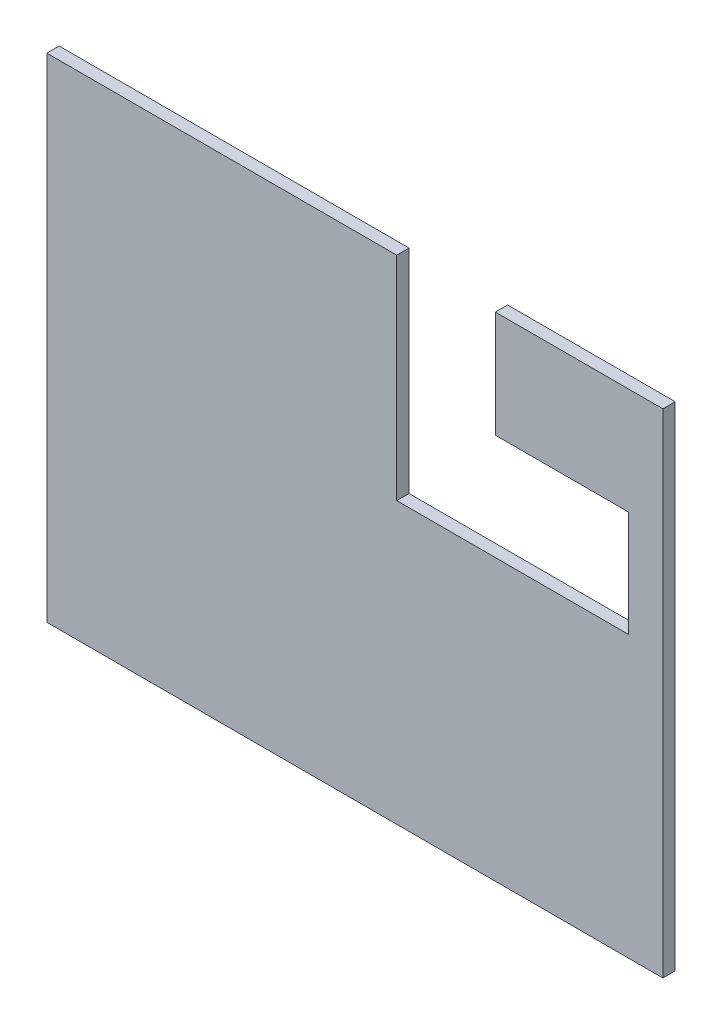
ISO-10303-21;
HEADER;
FILE_DESCRIPTION(('STEP AP214'),'2;1');
FILE_NAME('part.step','',(''),(''),'','','');
FILE_SCHEMA(('AUTOMOTIVE_DESIGN { 1 0 10303 214 1 1 1 1 }'));
ENDSEC;
DATA;
#1=APPLICATION_CONTEXT('core data for automotive mechanical design processes');
#2=APPLICATION_PROTOCOL_DEFINITION('international standard','automotive_design',2000,#1);
#3=PRODUCT_CONTEXT('',#1,'mechanical');
#4=PRODUCT('Part','Part','',(#3));
#5=PRODUCT_RELATED_PRODUCT_CATEGORY('part','',(#4));
#6=PRODUCT_DEFINITION_FORMATION('','',#4);
#7=PRODUCT_DEFINITION_CONTEXT('part definition',#1,'design');
#8=PRODUCT_DEFINITION('design','',#6,#7);
#9=PRODUCT_DEFINITION_SHAPE('','',#8);
#10=(LENGTH_UNIT() NAMED_UNIT(*) SI_UNIT(.MILLI.,.METRE.));
#11=(NAMED_UNIT(*) PLANE_ANGLE_UNIT() SI_UNIT($,.RADIAN.));
#12=(NAMED_UNIT(*) SI_UNIT($,.STERADIAN.) SOLID_ANGLE_UNIT());
#13=UNCERTAINTY_MEASURE_WITH_UNIT(LENGTH_MEASURE(1.E-05),#10,'distance_accuracy_value','');
#14=(GEOMETRIC_REPRESENTATION_CONTEXT(3) GLOBAL_UNCERTAINTY_ASSIGNED_CONTEXT((#13)) GLOBAL_UNIT_ASSIGNED_CONTEXT((#10,
#11,#12)) REPRESENTATION_CONTEXT('',''));
#15=CARTESIAN_POINT('',(0.,0.,0.));
#16=DIRECTION('',(0.,0.,1.));
#17=DIRECTION('',(1.,0.,0.));
#18=AXIS2_PLACEMENT_3D('',#15,#16,#17);
#19=CARTESIAN_POINT('',(-8.88178419700125E-13,4000.,100.));
#20=DIRECTION('',(0.,-1.,0.));
#21=DIRECTION('',(0.,0.,-1.));
#22=AXIS2_PLACEMENT_3D('',#19,#20,#21);
#23=PLANE('',#22);
#24=DIRECTION('',(-1.,0.,0.));
#25=VECTOR('',#24,1.);
#26=CARTESIAN_POINT('',(-8.88178419700125E-13,4000.,100.));
#27=LINE('',#26,#25);
#28=CARTESIAN_POINT('',(2840.,4000.,100.));
#29=VERTEX_POINT('',#28);
#30=CARTESIAN_POINT('',(-8.88178419700125E-13,4000.,100.));
#31=VERTEX_POINT('',#30);
#32=EDGE_CURVE('E57',#29,#31,#27,.T.);
#33=ORIENTED_EDGE('',*,*,#32,.F.);
#34=DIRECTION('',(0.,0.,1.));
#35=VECTOR('',#34,1.);
#36=CARTESIAN_POINT('',(2840.,4000.,0.));
#37=LINE('',#36,#35);
#38=CARTESIAN_POINT('',(2840.,4000.,0.));
#39=VERTEX_POINT('',#38);
#40=EDGE_CURVE('E167',#39,#29,#37,.T.);
#41=ORIENTED_EDGE('',*,*,#40,.F.);
#42=DIRECTION('',(-1.,0.,0.));
#43=VECTOR('',#42,1.);
#44=CARTESIAN_POINT('',(-8.88178419700125E-13,4000.,0.));
#45=LINE('',#44,#43);
#46=CARTESIAN_POINT('',(-8.88178419700125E-13,4000.,0.));
#47=VERTEX_POINT('',#46);
#48=EDGE_CURVE('E79',#39,#47,#45,.T.);
#49=ORIENTED_EDGE('',*,*,#48,.T.);
#50=DIRECTION('',(0.,0.,-1.));
#51=VECTOR('',#50,1.);
#52=CARTESIAN_POINT('',(-8.88178419700125E-13,4000.,100.));
#53=LINE('',#52,#51);
#54=EDGE_CURVE('E179',#31,#47,#53,.T.);
#55=ORIENTED_EDGE('',*,*,#54,.F.);
#56=EDGE_LOOP('',(#33,#41,#49,#55));
#57=FACE_BOUND('',#56,.T.);
#58=ADVANCED_FACE('F33',(#57),#23,.F.);
#59=CARTESIAN_POINT('',(0.,0.,100.));
#60=DIRECTION('',(1.,0.,0.));
#61=DIRECTION('',(0.,1.,0.));
#62=AXIS2_PLACEMENT_3D('',#59,#60,#61);
#63=PLANE('',#62);
#64=DIRECTION('',(0.,-1.,0.));
#65=VECTOR('',#64,1.);
#66=CARTESIAN_POINT('',(0.,0.,0.));
#67=LINE('',#66,#65);
#68=CARTESIAN_POINT('',(0.,0.,0.));
#69=VERTEX_POINT('',#68);
#70=EDGE_CURVE('E162',#47,#69,#67,.T.);
#71=ORIENTED_EDGE('',*,*,#70,.T.);
#72=DIRECTION('',(0.,0.,-1.));
#73=VECTOR('',#72,1.);
#74=CARTESIAN_POINT('',(0.,0.,100.));
#75=LINE('',#74,#73);
#76=CARTESIAN_POINT('',(0.,0.,100.));
#77=VERTEX_POINT('',#76);
#78=EDGE_CURVE('E11',#77,#69,#75,.T.);
#79=ORIENTED_EDGE('',*,*,#78,.F.);
#80=DIRECTION('',(0.,-1.,0.));
#81=VECTOR('',#80,1.);
#82=CARTESIAN_POINT('',(0.,0.,100.));
#83=LINE('',#82,#81);
#84=EDGE_CURVE('E170',#31,#77,#83,.T.);
#85=ORIENTED_EDGE('',*,*,#84,.F.);
#86=ORIENTED_EDGE('',*,*,#54,.T.);
#87=EDGE_LOOP('',(#71,#79,#85,#86));
#88=FACE_BOUND('',#87,.T.);
#89=ADVANCED_FACE('F35',(#88),#63,.F.);
#90=CARTESIAN_POINT('',(0.,0.,100.));
#91=DIRECTION('',(0.,1.,0.));
#92=DIRECTION('',(0.,0.,1.));
#93=AXIS2_PLACEMENT_3D('',#90,#91,#92);
#94=PLANE('',#93);
#95=DIRECTION('',(1.,0.,0.));
#96=VECTOR('',#95,1.);
#97=CARTESIAN_POINT('',(0.,0.,0.));
#98=LINE('',#97,#96);
#99=CARTESIAN_POINT('',(5000.,0.,0.));
#100=VERTEX_POINT('',#99);
#101=EDGE_CURVE('E182',#69,#100,#98,.T.);
#102=ORIENTED_EDGE('',*,*,#101,.T.);
#103=DIRECTION('',(0.,0.,-1.));
#104=VECTOR('',#103,1.);
#105=CARTESIAN_POINT('',(5000.,0.,100.));
#106=LINE('',#105,#104);
#107=CARTESIAN_POINT('',(5000.,0.,100.));
#108=VERTEX_POINT('',#107);
#109=EDGE_CURVE('E41',#108,#100,#106,.T.);
#110=ORIENTED_EDGE('',*,*,#109,.F.);
#111=DIRECTION('',(1.,0.,0.));
#112=VECTOR('',#111,1.);
#113=CARTESIAN_POINT('',(0.,0.,100.));
#114=LINE('',#113,#112);
#115=EDGE_CURVE('E86',#77,#108,#114,.T.);
#116=ORIENTED_EDGE('',*,*,#115,.F.);
#117=ORIENTED_EDGE('',*,*,#78,.T.);
#118=EDGE_LOOP('',(#102,#110,#116,#117));
#119=FACE_BOUND('',#118,.T.);
#120=ADVANCED_FACE('F205',(#119),#94,.F.);
#121=CARTESIAN_POINT('',(5000.,0.,100.));
#122=DIRECTION('',(-1.,0.,0.));
#123=DIRECTION('',(0.,-1.,0.));
#124=AXIS2_PLACEMENT_3D('',#121,#122,#123);
#125=PLANE('',#124);
#126=DIRECTION('',(0.,1.,0.));
#127=VECTOR('',#126,1.);
#128=CARTESIAN_POINT('',(5000.,0.,0.));
#129=LINE('',#128,#127);
#130=CARTESIAN_POINT('',(5000.,4000.,0.));
#131=VERTEX_POINT('',#130);
#132=EDGE_CURVE('E184',#100,#131,#129,.T.);
#133=ORIENTED_EDGE('',*,*,#132,.T.);
#134=DIRECTION('',(0.,0.,-1.));
#135=VECTOR('',#134,1.);
#136=CARTESIAN_POINT('',(5000.,4000.,100.));
#137=LINE('',#136,#135);
#138=CARTESIAN_POINT('',(5000.,4000.,100.));
#139=VERTEX_POINT('',#138);
#140=EDGE_CURVE('E188',#139,#131,#137,.T.);
#141=ORIENTED_EDGE('',*,*,#140,.F.);
#142=DIRECTION('',(0.,1.,0.));
#143=VECTOR('',#142,1.);
#144=CARTESIAN_POINT('',(5000.,0.,100.));
#145=LINE('',#144,#143);
#146=EDGE_CURVE('E174',#108,#139,#145,.T.);
#147=ORIENTED_EDGE('',*,*,#146,.F.);
#148=ORIENTED_EDGE('',*,*,#109,.T.);
#149=EDGE_LOOP('',(#133,#141,#147,#148));
#150=FACE_BOUND('',#149,.T.);
#151=ADVANCED_FACE('F194',(#150),#125,.F.);
#152=CARTESIAN_POINT('',(3640.,4000.,0.));
#153=VERTEX_POINT('',#152);
#154=EDGE_CURVE('E172',#131,#153,#45,.T.);
#155=ORIENTED_EDGE('',*,*,#154,.T.);
#156=DIRECTION('',(0.,0.,1.));
#157=VECTOR('',#156,1.);
#158=CARTESIAN_POINT('',(3640.,4000.,0.));
#159=LINE('',#158,#157);
#160=CARTESIAN_POINT('',(3640.,4000.,100.));
#161=VERTEX_POINT('',#160);
#162=EDGE_CURVE('E48',#153,#161,#159,.T.);
#163=ORIENTED_EDGE('',*,*,#162,.T.);
#164=EDGE_CURVE('E176',#139,#161,#27,.T.);
#165=ORIENTED_EDGE('',*,*,#164,.F.);
#166=ORIENTED_EDGE('',*,*,#140,.T.);
#167=EDGE_LOOP('',(#155,#163,#165,#166));
#168=FACE_BOUND('',#167,.T.);
#169=ADVANCED_FACE('F198',(#168),#23,.F.);
#170=CARTESIAN_POINT('',(0.,0.,100.));
#171=DIRECTION('',(0.,0.,-1.));
#172=DIRECTION('',(-1.,0.,0.));
#173=AXIS2_PLACEMENT_3D('',#170,#171,#172);
#174=PLANE('',#173);
#175=DIRECTION('',(1.,0.,0.));
#176=VECTOR('',#175,1.);
#177=CARTESIAN_POINT('',(2840.,2275.,100.));
#178=LINE('',#177,#176);
#179=CARTESIAN_POINT('',(2840.,2275.,100.));
#180=VERTEX_POINT('',#179);
#181=CARTESIAN_POINT('',(4720.,2275.,100.));
#182=VERTEX_POINT('',#181);
#183=EDGE_CURVE('E145',#180,#182,#178,.T.);
#184=ORIENTED_EDGE('',*,*,#183,.F.);
#185=DIRECTION('',(0.,-1.,0.));
#186=VECTOR('',#185,1.);
#187=CARTESIAN_POINT('',(2840.,4000.,100.));
#188=LINE('',#187,#186);
#189=EDGE_CURVE('E155',#29,#180,#188,.T.);
#190=ORIENTED_EDGE('',*,*,#189,.F.);
#191=ORIENTED_EDGE('',*,*,#32,.T.);
#192=ORIENTED_EDGE('',*,*,#84,.T.);
#193=ORIENTED_EDGE('',*,*,#115,.T.);
#194=ORIENTED_EDGE('',*,*,#146,.T.);
#195=ORIENTED_EDGE('',*,*,#164,.T.);
#196=DIRECTION('',(0.,1.,0.));
#197=VECTOR('',#196,1.);
#198=CARTESIAN_POINT('',(3640.,3135.,100.));
#199=LINE('',#198,#197);
#200=CARTESIAN_POINT('',(3640.,3135.,100.));
#201=VERTEX_POINT('',#200);
#202=EDGE_CURVE('E153',#201,#161,#199,.T.);
#203=ORIENTED_EDGE('',*,*,#202,.F.);
#204=DIRECTION('',(-1.,0.,0.));
#205=VECTOR('',#204,1.);
#206=CARTESIAN_POINT('',(4720.,3135.,100.));
#207=LINE('',#206,#205);
#208=CARTESIAN_POINT('',(4720.,3135.,100.));
#209=VERTEX_POINT('',#208);
#210=EDGE_CURVE('E127',#209,#201,#207,.T.);
#211=ORIENTED_EDGE('',*,*,#210,.F.);
#212=DIRECTION('',(0.,1.,0.));
#213=VECTOR('',#212,1.);
#214=CARTESIAN_POINT('',(4720.,3135.,100.));
#215=LINE('',#214,#213);
#216=EDGE_CURVE('E142',#182,#209,#215,.T.);
#217=ORIENTED_EDGE('',*,*,#216,.F.);
#218=EDGE_LOOP('',(#184,#190,#191,#192,#193,#194,#195,#203,#211,#217));
#219=FACE_BOUND('',#218,.T.);
#220=ADVANCED_FACE('F201',(#219),#174,.F.);
#221=CARTESIAN_POINT('',(0.,0.,0.));
#222=DIRECTION('',(0.,0.,-1.));
#223=DIRECTION('',(-1.,0.,0.));
#224=AXIS2_PLACEMENT_3D('',#221,#222,#223);
#225=PLANE('',#224);
#226=DIRECTION('',(0.,-1.,0.));
#227=VECTOR('',#226,1.);
#228=CARTESIAN_POINT('',(2840.,4000.,0.));
#229=LINE('',#228,#227);
#230=CARTESIAN_POINT('',(2840.,2275.,0.));
#231=VERTEX_POINT('',#230);
#232=EDGE_CURVE('E136',#39,#231,#229,.T.);
#233=ORIENTED_EDGE('',*,*,#232,.T.);
#234=DIRECTION('',(1.,0.,0.));
#235=VECTOR('',#234,1.);
#236=CARTESIAN_POINT('',(2840.,2275.,0.));
#237=LINE('',#236,#235);
#238=CARTESIAN_POINT('',(4720.,2275.,0.));
#239=VERTEX_POINT('',#238);
#240=EDGE_CURVE('E149',#231,#239,#237,.T.);
#241=ORIENTED_EDGE('',*,*,#240,.T.);
#242=DIRECTION('',(0.,1.,0.));
#243=VECTOR('',#242,1.);
#244=CARTESIAN_POINT('',(4720.,3135.,0.));
#245=LINE('',#244,#243);
#246=CARTESIAN_POINT('',(4720.,3135.,0.));
#247=VERTEX_POINT('',#246);
#248=EDGE_CURVE('E129',#239,#247,#245,.T.);
#249=ORIENTED_EDGE('',*,*,#248,.T.);
#250=DIRECTION('',(-1.,0.,0.));
#251=VECTOR('',#250,1.);
#252=CARTESIAN_POINT('',(4720.,3135.,0.));
#253=LINE('',#252,#251);
#254=CARTESIAN_POINT('',(3640.,3135.,0.));
#255=VERTEX_POINT('',#254);
#256=EDGE_CURVE('E124',#247,#255,#253,.T.);
#257=ORIENTED_EDGE('',*,*,#256,.T.);
#258=DIRECTION('',(0.,1.,0.));
#259=VECTOR('',#258,1.);
#260=CARTESIAN_POINT('',(3640.,3135.,0.));
#261=LINE('',#260,#259);
#262=EDGE_CURVE('E131',#255,#153,#261,.T.);
#263=ORIENTED_EDGE('',*,*,#262,.T.);
#264=ORIENTED_EDGE('',*,*,#154,.F.);
#265=ORIENTED_EDGE('',*,*,#132,.F.);
#266=ORIENTED_EDGE('',*,*,#101,.F.);
#267=ORIENTED_EDGE('',*,*,#70,.F.);
#268=ORIENTED_EDGE('',*,*,#48,.F.);
#269=EDGE_LOOP('',(#233,#241,#249,#257,#263,#264,#265,#266,#267,#268));
#270=FACE_BOUND('',#269,.T.);
#271=ADVANCED_FACE('F139',(#270),#225,.T.);
#272=CARTESIAN_POINT('',(4720.,3135.,0.));
#273=DIRECTION('',(0.,1.,0.));
#274=DIRECTION('',(0.,0.,1.));
#275=AXIS2_PLACEMENT_3D('',#272,#273,#274);
#276=PLANE('',#275);
#277=ORIENTED_EDGE('',*,*,#210,.T.);
#278=DIRECTION('',(0.,0.,1.));
#279=VECTOR('',#278,1.);
#280=CARTESIAN_POINT('',(3640.,3135.,0.));
#281=LINE('',#280,#279);
#282=EDGE_CURVE('E121',#255,#201,#281,.T.);
#283=ORIENTED_EDGE('',*,*,#282,.F.);
#284=ORIENTED_EDGE('',*,*,#256,.F.);
#285=DIRECTION('',(0.,0.,1.));
#286=VECTOR('',#285,1.);
#287=CARTESIAN_POINT('',(4720.,3135.,0.));
#288=LINE('',#287,#286);
#289=EDGE_CURVE('E160',#247,#209,#288,.T.);
#290=ORIENTED_EDGE('',*,*,#289,.T.);
#291=EDGE_LOOP('',(#277,#283,#284,#290));
#292=FACE_BOUND('',#291,.T.);
#293=ADVANCED_FACE('F122',(#292),#276,.F.);
#294=CARTESIAN_POINT('',(4720.,3135.,0.));
#295=DIRECTION('',(1.,0.,0.));
#296=DIRECTION('',(0.,0.,-1.));
#297=AXIS2_PLACEMENT_3D('',#294,#295,#296);
#298=PLANE('',#297);
#299=ORIENTED_EDGE('',*,*,#216,.T.);
#300=ORIENTED_EDGE('',*,*,#289,.F.);
#301=ORIENTED_EDGE('',*,*,#248,.F.);
#302=DIRECTION('',(0.,0.,1.));
#303=VECTOR('',#302,1.);
#304=CARTESIAN_POINT('',(4720.,2275.,0.));
#305=LINE('',#304,#303);
#306=EDGE_CURVE('E163',#239,#182,#305,.T.);
#307=ORIENTED_EDGE('',*,*,#306,.T.);
#308=EDGE_LOOP('',(#299,#300,#301,#307));
#309=FACE_BOUND('',#308,.T.);
#310=ADVANCED_FACE('F228',(#309),#298,.F.);
#311=CARTESIAN_POINT('',(2840.,2275.,0.));
#312=DIRECTION('',(0.,-1.,0.));
#313=DIRECTION('',(0.,0.,-1.));
#314=AXIS2_PLACEMENT_3D('',#311,#312,#313);
#315=PLANE('',#314);
#316=ORIENTED_EDGE('',*,*,#183,.T.);
#317=ORIENTED_EDGE('',*,*,#306,.F.);
#318=ORIENTED_EDGE('',*,*,#240,.F.);
#319=DIRECTION('',(0.,0.,1.));
#320=VECTOR('',#319,1.);
#321=CARTESIAN_POINT('',(2840.,2275.,0.));
#322=LINE('',#321,#320);
#323=EDGE_CURVE('E165',#231,#180,#322,.T.);
#324=ORIENTED_EDGE('',*,*,#323,.T.);
#325=EDGE_LOOP('',(#316,#317,#318,#324));
#326=FACE_BOUND('',#325,.T.);
#327=ADVANCED_FACE('F234',(#326),#315,.F.);
#328=CARTESIAN_POINT('',(2840.,4000.,0.));
#329=DIRECTION('',(-1.,0.,0.));
#330=DIRECTION('',(0.,0.,1.));
#331=AXIS2_PLACEMENT_3D('',#328,#329,#330);
#332=PLANE('',#331);
#333=ORIENTED_EDGE('',*,*,#189,.T.);
#334=ORIENTED_EDGE('',*,*,#323,.F.);
#335=ORIENTED_EDGE('',*,*,#232,.F.);
#336=ORIENTED_EDGE('',*,*,#40,.T.);
#337=EDGE_LOOP('',(#333,#334,#335,#336));
#338=FACE_BOUND('',#337,.T.);
#339=ADVANCED_FACE('F231',(#338),#332,.F.);
#340=CARTESIAN_POINT('',(3640.,3135.,0.));
#341=DIRECTION('',(1.,0.,0.));
#342=DIRECTION('',(0.,0.,-1.));
#343=AXIS2_PLACEMENT_3D('',#340,#341,#342);
#344=PLANE('',#343);
#345=ORIENTED_EDGE('',*,*,#202,.T.);
#346=ORIENTED_EDGE('',*,*,#162,.F.);
#347=ORIENTED_EDGE('',*,*,#262,.F.);
#348=ORIENTED_EDGE('',*,*,#282,.T.);
#349=EDGE_LOOP('',(#345,#346,#347,#348));
#350=FACE_BOUND('',#349,.T.);
#351=ADVANCED_FACE('F132',(#350),#344,.F.);
#352=CLOSED_SHELL('',(#58,#89,#120,#151,#169,#220,#271,#293,#310,#327,#339,#351));
#353=MANIFOLD_SOLID_BREP('B2',#352);
#354=ADVANCED_BREP_SHAPE_REPRESENTATION('',(#18,#353),#14);
#355=SHAPE_DEFINITION_REPRESENTATION(#9,#354);
ENDSEC;
END-ISO-10303-21;
